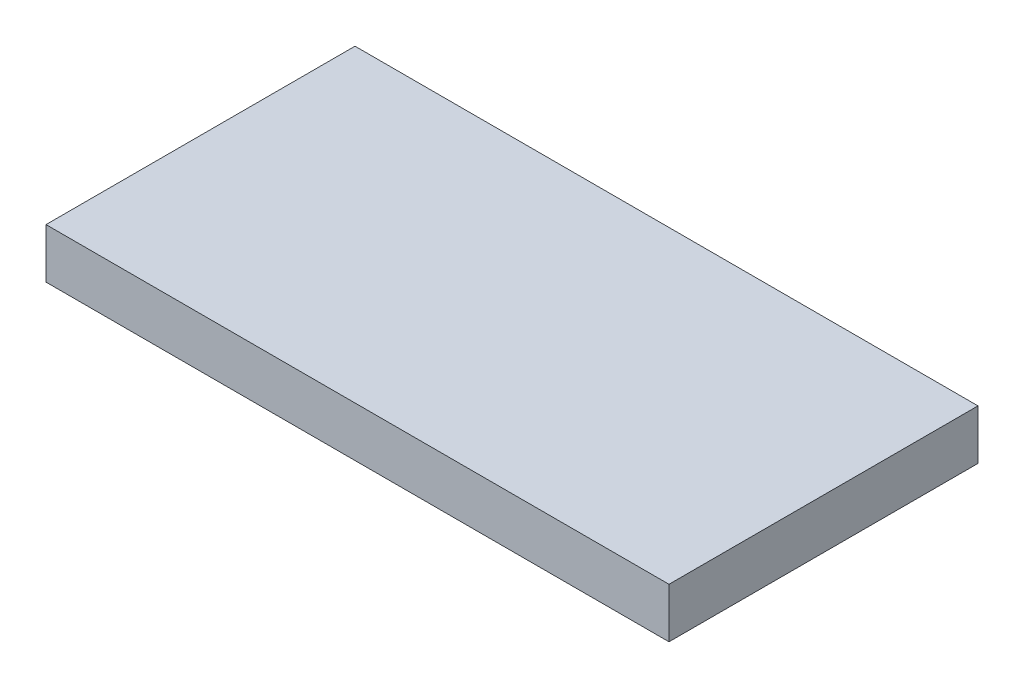
ISO-10303-21;
HEADER;
FILE_DESCRIPTION(('STEP AP214'),'2;1');
FILE_NAME('part.step','',(''),(''),'','','');
FILE_SCHEMA(('AUTOMOTIVE_DESIGN { 1 0 10303 214 1 1 1 1 }'));
ENDSEC;
DATA;
#1=APPLICATION_CONTEXT('core data for automotive mechanical design processes');
#2=APPLICATION_PROTOCOL_DEFINITION('international standard','automotive_design',2000,#1);
#3=PRODUCT_CONTEXT('',#1,'mechanical');
#4=PRODUCT('Part','Part','',(#3));
#5=PRODUCT_RELATED_PRODUCT_CATEGORY('part','',(#4));
#6=PRODUCT_DEFINITION_FORMATION('','',#4);
#7=PRODUCT_DEFINITION_CONTEXT('part definition',#1,'design');
#8=PRODUCT_DEFINITION('design','',#6,#7);
#9=PRODUCT_DEFINITION_SHAPE('','',#8);
#10=(LENGTH_UNIT() NAMED_UNIT(*) SI_UNIT(.MILLI.,.METRE.));
#11=(NAMED_UNIT(*) PLANE_ANGLE_UNIT() SI_UNIT($,.RADIAN.));
#12=(NAMED_UNIT(*) SI_UNIT($,.STERADIAN.) SOLID_ANGLE_UNIT());
#13=UNCERTAINTY_MEASURE_WITH_UNIT(LENGTH_MEASURE(1.E-05),#10,'distance_accuracy_value','');
#14=(GEOMETRIC_REPRESENTATION_CONTEXT(3) GLOBAL_UNCERTAINTY_ASSIGNED_CONTEXT((#13)) GLOBAL_UNIT_ASSIGNED_CONTEXT((#10,
#11,#12)) REPRESENTATION_CONTEXT('',''));
#15=CARTESIAN_POINT('',(0.,0.,0.));
#16=DIRECTION('',(0.,0.,1.));
#17=DIRECTION('',(1.,0.,0.));
#18=AXIS2_PLACEMENT_3D('',#15,#16,#17);
#19=CARTESIAN_POINT('',(6.59572874991415,38.4864983767566,241.582925809299));
#20=DIRECTION('',(0.,1.,0.));
#21=DIRECTION('',(0.,0.,1.));
#22=AXIS2_PLACEMENT_3D('',#19,#20,#21);
#23=PLANE('',#22);
#24=DIRECTION('',(0.,0.,-1.));
#25=VECTOR('',#24,1.);
#26=CARTESIAN_POINT('',(5.00822874991416,38.4864983767566,240.795525809299));
#27=LINE('',#26,#25);
#28=CARTESIAN_POINT('',(5.00822874991416,38.4864983767566,242.370325809298));
#29=VERTEX_POINT('',#28);
#30=CARTESIAN_POINT('',(5.00822874991416,38.4864983767566,240.795525809299));
#31=VERTEX_POINT('',#30);
#32=EDGE_CURVE('E20',#29,#31,#27,.T.);
#33=ORIENTED_EDGE('',*,*,#32,.T.);
#34=DIRECTION('',(1.,0.,0.));
#35=VECTOR('',#34,1.);
#36=CARTESIAN_POINT('',(5.00822874991416,38.4864983767566,240.795525809299));
#37=LINE('',#36,#35);
#38=CARTESIAN_POINT('',(8.18322874991415,38.4864983767566,240.795525809299));
#39=VERTEX_POINT('',#38);
#40=EDGE_CURVE('E87',#31,#39,#37,.T.);
#41=ORIENTED_EDGE('',*,*,#40,.T.);
#42=DIRECTION('',(0.,0.,1.));
#43=VECTOR('',#42,1.);
#44=CARTESIAN_POINT('',(8.18322874991415,38.4864983767566,240.795525809299));
#45=LINE('',#44,#43);
#46=CARTESIAN_POINT('',(8.18322874991415,38.4864983767566,242.370325809298));
#47=VERTEX_POINT('',#46);
#48=EDGE_CURVE('E56',#39,#47,#45,.T.);
#49=ORIENTED_EDGE('',*,*,#48,.T.);
#50=DIRECTION('',(-1.,0.,0.));
#51=VECTOR('',#50,1.);
#52=CARTESIAN_POINT('',(5.00822874991416,38.4864983767566,242.370325809298));
#53=LINE('',#52,#51);
#54=EDGE_CURVE('E58',#47,#29,#53,.T.);
#55=ORIENTED_EDGE('',*,*,#54,.T.);
#56=EDGE_LOOP('',(#33,#41,#49,#55));
#57=FACE_BOUND('',#56,.T.);
#58=ADVANCED_FACE('F17',(#57),#23,.F.);
#59=CARTESIAN_POINT('',(5.00822874991416,38.7404983767566,240.795525809299));
#60=DIRECTION('',(1.,0.,0.));
#61=DIRECTION('',(0.,0.,-1.));
#62=AXIS2_PLACEMENT_3D('',#59,#60,#61);
#63=PLANE('',#62);
#64=DIRECTION('',(0.,0.,1.));
#65=VECTOR('',#64,1.);
#66=CARTESIAN_POINT('',(5.00822874991416,38.7404983767566,241.582925809299));
#67=LINE('',#66,#65);
#68=CARTESIAN_POINT('',(5.00822874991416,38.7404983767566,240.795525809299));
#69=VERTEX_POINT('',#68);
#70=CARTESIAN_POINT('',(5.00822874991416,38.7404983767566,242.370325809298));
#71=VERTEX_POINT('',#70);
#72=EDGE_CURVE('E94',#69,#71,#67,.T.);
#73=ORIENTED_EDGE('',*,*,#72,.F.);
#74=DIRECTION('',(0.,1.,0.));
#75=VECTOR('',#74,1.);
#76=CARTESIAN_POINT('',(5.00822874991416,38.7404983767566,240.795525809299));
#77=LINE('',#76,#75);
#78=EDGE_CURVE('E70',#69,#31,#77,.F.);
#79=ORIENTED_EDGE('',*,*,#78,.T.);
#80=ORIENTED_EDGE('',*,*,#32,.F.);
#81=DIRECTION('',(0.,1.,0.));
#82=VECTOR('',#81,1.);
#83=CARTESIAN_POINT('',(5.00822874991416,38.7404983767566,242.370325809298));
#84=LINE('',#83,#82);
#85=EDGE_CURVE('E65',#29,#71,#84,.T.);
#86=ORIENTED_EDGE('',*,*,#85,.T.);
#87=EDGE_LOOP('',(#73,#79,#80,#86));
#88=FACE_BOUND('',#87,.T.);
#89=ADVANCED_FACE('F67',(#88),#63,.F.);
#90=CARTESIAN_POINT('',(5.00822874991416,38.7404983767566,242.370325809298));
#91=DIRECTION('',(0.,0.,-1.));
#92=DIRECTION('',(-1.,0.,0.));
#93=AXIS2_PLACEMENT_3D('',#90,#91,#92);
#94=PLANE('',#93);
#95=DIRECTION('',(1.,0.,0.));
#96=VECTOR('',#95,1.);
#97=CARTESIAN_POINT('',(6.59572874991415,38.7404983767566,242.370325809298));
#98=LINE('',#97,#96);
#99=CARTESIAN_POINT('',(8.18322874991415,38.7404983767566,242.370325809298));
#100=VERTEX_POINT('',#99);
#101=EDGE_CURVE('E75',#71,#100,#98,.T.);
#102=ORIENTED_EDGE('',*,*,#101,.F.);
#103=ORIENTED_EDGE('',*,*,#85,.F.);
#104=ORIENTED_EDGE('',*,*,#54,.F.);
#105=DIRECTION('',(0.,1.,0.));
#106=VECTOR('',#105,1.);
#107=CARTESIAN_POINT('',(8.18322874991415,38.7404983767566,242.370325809298));
#108=LINE('',#107,#106);
#109=EDGE_CURVE('E82',#47,#100,#108,.T.);
#110=ORIENTED_EDGE('',*,*,#109,.T.);
#111=EDGE_LOOP('',(#102,#103,#104,#110));
#112=FACE_BOUND('',#111,.T.);
#113=ADVANCED_FACE('F73',(#112),#94,.F.);
#114=CARTESIAN_POINT('',(8.18322874991415,38.7404983767566,240.795525809299));
#115=DIRECTION('',(-1.,0.,0.));
#116=DIRECTION('',(0.,0.,1.));
#117=AXIS2_PLACEMENT_3D('',#114,#115,#116);
#118=PLANE('',#117);
#119=DIRECTION('',(0.,0.,1.));
#120=VECTOR('',#119,1.);
#121=CARTESIAN_POINT('',(8.18322874991415,38.7404983767566,241.582925809299));
#122=LINE('',#121,#120);
#123=CARTESIAN_POINT('',(8.18322874991415,38.7404983767566,240.795525809299));
#124=VERTEX_POINT('',#123);
#125=EDGE_CURVE('E27',#100,#124,#122,.F.);
#126=ORIENTED_EDGE('',*,*,#125,.F.);
#127=ORIENTED_EDGE('',*,*,#109,.F.);
#128=ORIENTED_EDGE('',*,*,#48,.F.);
#129=DIRECTION('',(0.,1.,0.));
#130=VECTOR('',#129,1.);
#131=CARTESIAN_POINT('',(8.18322874991415,38.7404983767566,240.795525809299));
#132=LINE('',#131,#130);
#133=EDGE_CURVE('E36',#39,#124,#132,.T.);
#134=ORIENTED_EDGE('',*,*,#133,.T.);
#135=EDGE_LOOP('',(#126,#127,#128,#134));
#136=FACE_BOUND('',#135,.T.);
#137=ADVANCED_FACE('F102',(#136),#118,.F.);
#138=CARTESIAN_POINT('',(5.00822874991416,38.7404983767566,240.795525809299));
#139=DIRECTION('',(0.,0.,1.));
#140=DIRECTION('',(1.,0.,0.));
#141=AXIS2_PLACEMENT_3D('',#138,#139,#140);
#142=PLANE('',#141);
#143=DIRECTION('',(1.,0.,0.));
#144=VECTOR('',#143,1.);
#145=CARTESIAN_POINT('',(6.59572874991415,38.7404983767566,240.795525809299));
#146=LINE('',#145,#144);
#147=EDGE_CURVE('E11',#124,#69,#146,.F.);
#148=ORIENTED_EDGE('',*,*,#147,.F.);
#149=ORIENTED_EDGE('',*,*,#133,.F.);
#150=ORIENTED_EDGE('',*,*,#40,.F.);
#151=ORIENTED_EDGE('',*,*,#78,.F.);
#152=EDGE_LOOP('',(#148,#149,#150,#151));
#153=FACE_BOUND('',#152,.T.);
#154=ADVANCED_FACE('F104',(#153),#142,.F.);
#155=CARTESIAN_POINT('',(6.59572874991415,38.7404983767566,241.582925809299));
#156=DIRECTION('',(0.,1.,0.));
#157=DIRECTION('',(0.,0.,1.));
#158=AXIS2_PLACEMENT_3D('',#155,#156,#157);
#159=PLANE('',#158);
#160=ORIENTED_EDGE('',*,*,#125,.T.);
#161=ORIENTED_EDGE('',*,*,#147,.T.);
#162=ORIENTED_EDGE('',*,*,#72,.T.);
#163=ORIENTED_EDGE('',*,*,#101,.T.);
#164=EDGE_LOOP('',(#160,#161,#162,#163));
#165=FACE_BOUND('',#164,.T.);
#166=ADVANCED_FACE('F101',(#165),#159,.T.);
#167=CLOSED_SHELL('',(#58,#89,#113,#137,#154,#166));
#168=MANIFOLD_SOLID_BREP('B1',#167);
#169=ADVANCED_BREP_SHAPE_REPRESENTATION('',(#18,#168),#14);
#170=SHAPE_DEFINITION_REPRESENTATION(#9,#169);
ENDSEC;
END-ISO-10303-21;
